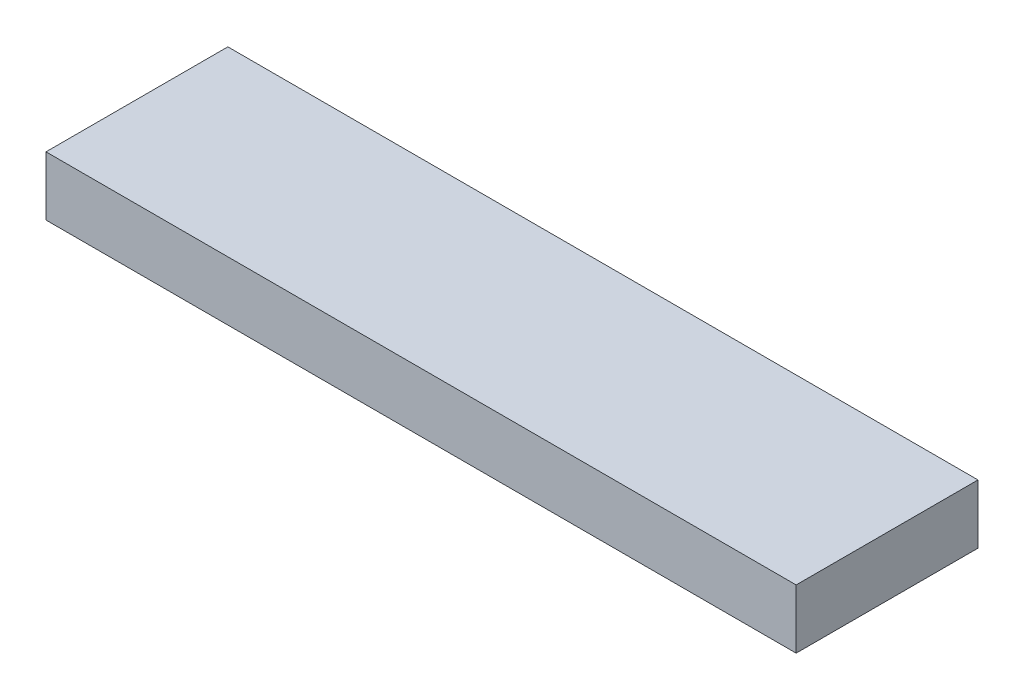
ISO-10303-21;
HEADER;
FILE_DESCRIPTION(('STEP AP214'),'2;1');
FILE_NAME('part.step','',(''),(''),'','','');
FILE_SCHEMA(('AUTOMOTIVE_DESIGN { 1 0 10303 214 1 1 1 1 }'));
ENDSEC;
DATA;
#1=APPLICATION_CONTEXT('core data for automotive mechanical design processes');
#2=APPLICATION_PROTOCOL_DEFINITION('international standard','automotive_design',2000,#1);
#3=PRODUCT_CONTEXT('',#1,'mechanical');
#4=PRODUCT('Part','Part','',(#3));
#5=PRODUCT_RELATED_PRODUCT_CATEGORY('part','',(#4));
#6=PRODUCT_DEFINITION_FORMATION('','',#4);
#7=PRODUCT_DEFINITION_CONTEXT('part definition',#1,'design');
#8=PRODUCT_DEFINITION('design','',#6,#7);
#9=PRODUCT_DEFINITION_SHAPE('','',#8);
#10=(LENGTH_UNIT() NAMED_UNIT(*) SI_UNIT(.MILLI.,.METRE.));
#11=(NAMED_UNIT(*) PLANE_ANGLE_UNIT() SI_UNIT($,.RADIAN.));
#12=(NAMED_UNIT(*) SI_UNIT($,.STERADIAN.) SOLID_ANGLE_UNIT());
#13=UNCERTAINTY_MEASURE_WITH_UNIT(LENGTH_MEASURE(1.E-05),#10,'distance_accuracy_value','');
#14=(GEOMETRIC_REPRESENTATION_CONTEXT(3) GLOBAL_UNCERTAINTY_ASSIGNED_CONTEXT((#13)) GLOBAL_UNIT_ASSIGNED_CONTEXT((#10,
#11,#12)) REPRESENTATION_CONTEXT('',''));
#15=CARTESIAN_POINT('',(0.,0.,0.));
#16=DIRECTION('',(0.,0.,1.));
#17=DIRECTION('',(1.,0.,0.));
#18=AXIS2_PLACEMENT_3D('',#15,#16,#17);
#19=CARTESIAN_POINT('',(20.955,3.302,-5.08));
#20=DIRECTION('',(-1.,0.,0.));
#21=DIRECTION('',(0.,0.,1.));
#22=AXIS2_PLACEMENT_3D('',#19,#20,#21);
#23=PLANE('',#22);
#24=DIRECTION('',(0.,0.,-1.));
#25=VECTOR('',#24,1.);
#26=CARTESIAN_POINT('',(20.955,0.,-5.08));
#27=LINE('',#26,#25);
#28=CARTESIAN_POINT('',(20.955,0.,5.08));
#29=VERTEX_POINT('',#28);
#30=CARTESIAN_POINT('',(20.955,0.,-5.08));
#31=VERTEX_POINT('',#30);
#32=EDGE_CURVE('E106',#29,#31,#27,.T.);
#33=ORIENTED_EDGE('',*,*,#32,.T.);
#34=DIRECTION('',(0.,-1.,0.));
#35=VECTOR('',#34,1.);
#36=CARTESIAN_POINT('',(20.955,3.302,-5.08));
#37=LINE('',#36,#35);
#38=CARTESIAN_POINT('',(20.955,3.302,-5.08));
#39=VERTEX_POINT('',#38);
#40=EDGE_CURVE('E97',#39,#31,#37,.T.);
#41=ORIENTED_EDGE('',*,*,#40,.F.);
#42=DIRECTION('',(0.,0.,-1.));
#43=VECTOR('',#42,1.);
#44=CARTESIAN_POINT('',(20.955,3.302,-5.08));
#45=LINE('',#44,#43);
#46=CARTESIAN_POINT('',(20.955,3.302,5.08));
#47=VERTEX_POINT('',#46);
#48=EDGE_CURVE('E91',#47,#39,#45,.T.);
#49=ORIENTED_EDGE('',*,*,#48,.F.);
#50=DIRECTION('',(0.,-1.,0.));
#51=VECTOR('',#50,1.);
#52=CARTESIAN_POINT('',(20.955,3.302,5.08));
#53=LINE('',#52,#51);
#54=EDGE_CURVE('E102',#47,#29,#53,.T.);
#55=ORIENTED_EDGE('',*,*,#54,.T.);
#56=EDGE_LOOP('',(#33,#41,#49,#55));
#57=FACE_BOUND('',#56,.T.);
#58=ADVANCED_FACE('F39',(#57),#23,.F.);
#59=CARTESIAN_POINT('',(-20.955,3.302,-5.08));
#60=DIRECTION('',(0.,0.,1.));
#61=DIRECTION('',(1.,0.,0.));
#62=AXIS2_PLACEMENT_3D('',#59,#60,#61);
#63=PLANE('',#62);
#64=DIRECTION('',(-1.,0.,0.));
#65=VECTOR('',#64,1.);
#66=CARTESIAN_POINT('',(-20.955,0.,-5.08));
#67=LINE('',#66,#65);
#68=CARTESIAN_POINT('',(-20.955,0.,-5.08));
#69=VERTEX_POINT('',#68);
#70=EDGE_CURVE('E96',#31,#69,#67,.T.);
#71=ORIENTED_EDGE('',*,*,#70,.T.);
#72=DIRECTION('',(0.,-1.,0.));
#73=VECTOR('',#72,1.);
#74=CARTESIAN_POINT('',(-20.955,3.302,-5.08));
#75=LINE('',#74,#73);
#76=CARTESIAN_POINT('',(-20.955,3.302,-5.08));
#77=VERTEX_POINT('',#76);
#78=EDGE_CURVE('E94',#77,#69,#75,.T.);
#79=ORIENTED_EDGE('',*,*,#78,.F.);
#80=DIRECTION('',(-1.,0.,0.));
#81=VECTOR('',#80,1.);
#82=CARTESIAN_POINT('',(-20.955,3.302,-5.08));
#83=LINE('',#82,#81);
#84=EDGE_CURVE('E86',#39,#77,#83,.T.);
#85=ORIENTED_EDGE('',*,*,#84,.F.);
#86=ORIENTED_EDGE('',*,*,#40,.T.);
#87=EDGE_LOOP('',(#71,#79,#85,#86));
#88=FACE_BOUND('',#87,.T.);
#89=ADVANCED_FACE('F95',(#88),#63,.F.);
#90=CARTESIAN_POINT('',(-20.955,3.302,-5.08));
#91=DIRECTION('',(1.,0.,0.));
#92=DIRECTION('',(0.,0.,-1.));
#93=AXIS2_PLACEMENT_3D('',#90,#91,#92);
#94=PLANE('',#93);
#95=DIRECTION('',(0.,0.,1.));
#96=VECTOR('',#95,1.);
#97=CARTESIAN_POINT('',(-20.955,0.,-5.08));
#98=LINE('',#97,#96);
#99=CARTESIAN_POINT('',(-20.955,0.,5.08));
#100=VERTEX_POINT('',#99);
#101=EDGE_CURVE('E72',#69,#100,#98,.T.);
#102=ORIENTED_EDGE('',*,*,#101,.T.);
#103=DIRECTION('',(0.,-1.,0.));
#104=VECTOR('',#103,1.);
#105=CARTESIAN_POINT('',(-20.955,3.302,5.08));
#106=LINE('',#105,#104);
#107=CARTESIAN_POINT('',(-20.955,3.302,5.08));
#108=VERTEX_POINT('',#107);
#109=EDGE_CURVE('E98',#108,#100,#106,.T.);
#110=ORIENTED_EDGE('',*,*,#109,.F.);
#111=DIRECTION('',(0.,0.,1.));
#112=VECTOR('',#111,1.);
#113=CARTESIAN_POINT('',(-20.955,3.302,-5.08));
#114=LINE('',#113,#112);
#115=EDGE_CURVE('E89',#77,#108,#114,.T.);
#116=ORIENTED_EDGE('',*,*,#115,.F.);
#117=ORIENTED_EDGE('',*,*,#78,.T.);
#118=EDGE_LOOP('',(#102,#110,#116,#117));
#119=FACE_BOUND('',#118,.T.);
#120=ADVANCED_FACE('F100',(#119),#94,.F.);
#121=CARTESIAN_POINT('',(-20.955,3.302,5.08));
#122=DIRECTION('',(0.,0.,-1.));
#123=DIRECTION('',(-1.,0.,0.));
#124=AXIS2_PLACEMENT_3D('',#121,#122,#123);
#125=PLANE('',#124);
#126=DIRECTION('',(1.,0.,0.));
#127=VECTOR('',#126,1.);
#128=CARTESIAN_POINT('',(-20.955,0.,5.08));
#129=LINE('',#128,#127);
#130=EDGE_CURVE('E78',#100,#29,#129,.T.);
#131=ORIENTED_EDGE('',*,*,#130,.T.);
#132=ORIENTED_EDGE('',*,*,#54,.F.);
#133=DIRECTION('',(1.,0.,0.));
#134=VECTOR('',#133,1.);
#135=CARTESIAN_POINT('',(-20.955,3.302,5.08));
#136=LINE('',#135,#134);
#137=EDGE_CURVE('E55',#108,#47,#136,.T.);
#138=ORIENTED_EDGE('',*,*,#137,.F.);
#139=ORIENTED_EDGE('',*,*,#109,.T.);
#140=EDGE_LOOP('',(#131,#132,#138,#139));
#141=FACE_BOUND('',#140,.T.);
#142=ADVANCED_FACE('F138',(#141),#125,.F.);
#143=CARTESIAN_POINT('',(0.,3.302,0.));
#144=DIRECTION('',(0.,1.,0.));
#145=DIRECTION('',(0.,0.,1.));
#146=AXIS2_PLACEMENT_3D('',#143,#144,#145);
#147=PLANE('',#146);
#148=ORIENTED_EDGE('',*,*,#48,.T.);
#149=ORIENTED_EDGE('',*,*,#84,.T.);
#150=ORIENTED_EDGE('',*,*,#115,.T.);
#151=ORIENTED_EDGE('',*,*,#137,.T.);
#152=EDGE_LOOP('',(#148,#149,#150,#151));
#153=FACE_BOUND('',#152,.T.);
#154=ADVANCED_FACE('F87',(#153),#147,.T.);
#155=CARTESIAN_POINT('',(0.,0.,0.));
#156=DIRECTION('',(0.,1.,0.));
#157=DIRECTION('',(0.,0.,1.));
#158=AXIS2_PLACEMENT_3D('',#155,#156,#157);
#159=PLANE('',#158);
#160=CARTESIAN_POINT('',(13.462,0.,0.));
#161=DIRECTION('',(0.,1.,0.));
#162=DIRECTION('',(0.,0.,1.));
#163=AXIS2_PLACEMENT_3D('',#160,#161,#162);
#164=CIRCLE('',#163,1.17403767481021);
#165=CARTESIAN_POINT('',(13.462,0.,1.17403767481022));
#166=VERTEX_POINT('',#165);
#167=EDGE_CURVE('E11',#166,#166,#164,.F.);
#168=ORIENTED_EDGE('',*,*,#167,.F.);
#169=EDGE_LOOP('',(#168));
#170=FACE_BOUND('',#169,.T.);
#171=CARTESIAN_POINT('',(8.128,0.,0.));
#172=DIRECTION('',(0.,1.,0.));
#173=DIRECTION('',(0.,0.,1.));
#174=AXIS2_PLACEMENT_3D('',#171,#172,#173);
#175=CIRCLE('',#174,1.17403767481021);
#176=CARTESIAN_POINT('',(8.128,0.,1.17403767481022));
#177=VERTEX_POINT('',#176);
#178=EDGE_CURVE('E47',#177,#177,#175,.F.);
#179=ORIENTED_EDGE('',*,*,#178,.F.);
#180=EDGE_LOOP('',(#179));
#181=FACE_BOUND('',#180,.T.);
#182=CARTESIAN_POINT('',(-8.128,0.,0.));
#183=DIRECTION('',(0.,1.,0.));
#184=DIRECTION('',(0.,0.,1.));
#185=AXIS2_PLACEMENT_3D('',#182,#183,#184);
#186=CIRCLE('',#185,1.17403767481021);
#187=CARTESIAN_POINT('',(-8.128,0.,1.17403767481022));
#188=VERTEX_POINT('',#187);
#189=EDGE_CURVE('E119',#188,#188,#186,.F.);
#190=ORIENTED_EDGE('',*,*,#189,.F.);
#191=EDGE_LOOP('',(#190));
#192=FACE_BOUND('',#191,.T.);
#193=CARTESIAN_POINT('',(-13.462,0.,0.));
#194=DIRECTION('',(0.,1.,0.));
#195=DIRECTION('',(0.,0.,1.));
#196=AXIS2_PLACEMENT_3D('',#193,#194,#195);
#197=CIRCLE('',#196,1.17403767481021);
#198=CARTESIAN_POINT('',(-13.462,0.,1.17403767481022));
#199=VERTEX_POINT('',#198);
#200=EDGE_CURVE('E116',#199,#199,#197,.F.);
#201=ORIENTED_EDGE('',*,*,#200,.F.);
#202=EDGE_LOOP('',(#201));
#203=FACE_BOUND('',#202,.T.);
#204=ORIENTED_EDGE('',*,*,#32,.F.);
#205=ORIENTED_EDGE('',*,*,#130,.F.);
#206=ORIENTED_EDGE('',*,*,#101,.F.);
#207=ORIENTED_EDGE('',*,*,#70,.F.);
#208=EDGE_LOOP('',(#204,#205,#206,#207));
#209=FACE_BOUND('',#208,.T.);
#210=ADVANCED_FACE('F126',(#170,#181,#192,#203,#209),#159,.F.);
#211=CARTESIAN_POINT('',(-13.462,-0.635,0.));
#212=DIRECTION('',(0.,1.,0.));
#213=DIRECTION('',(0.,0.,1.));
#214=AXIS2_PLACEMENT_3D('',#211,#212,#213);
#215=CYLINDRICAL_SURFACE('',#214,1.17403767481021);
#216=CARTESIAN_POINT('',(-13.462,-0.635,0.));
#217=DIRECTION('',(0.,-1.,0.));
#218=DIRECTION('',(0.,0.,-1.));
#219=AXIS2_PLACEMENT_3D('',#216,#217,#218);
#220=CIRCLE('',#219,1.17403767481021);
#221=CARTESIAN_POINT('',(-13.462,-0.635,-1.17403767481021));
#222=VERTEX_POINT('',#221);
#223=EDGE_CURVE('E109',#222,#222,#220,.T.);
#224=ORIENTED_EDGE('',*,*,#223,.F.);
#225=EDGE_LOOP('',(#224));
#226=FACE_BOUND('',#225,.T.);
#227=ORIENTED_EDGE('',*,*,#200,.T.);
#228=EDGE_LOOP('',(#227));
#229=FACE_BOUND('',#228,.T.);
#230=ADVANCED_FACE('F129',(#226,#229),#215,.T.);
#231=CARTESIAN_POINT('',(-13.462,-0.635,0.));
#232=DIRECTION('',(0.,-1.,0.));
#233=DIRECTION('',(0.,0.,-1.));
#234=AXIS2_PLACEMENT_3D('',#231,#232,#233);
#235=PLANE('',#234);
#236=ORIENTED_EDGE('',*,*,#223,.T.);
#237=EDGE_LOOP('',(#236));
#238=FACE_BOUND('',#237,.T.);
#239=ADVANCED_FACE('F184',(#238),#235,.T.);
#240=CARTESIAN_POINT('',(-8.128,-0.635,0.));
#241=DIRECTION('',(0.,1.,0.));
#242=DIRECTION('',(0.,0.,1.));
#243=AXIS2_PLACEMENT_3D('',#240,#241,#242);
#244=CYLINDRICAL_SURFACE('',#243,1.17403767481021);
#245=CARTESIAN_POINT('',(-8.128,-0.635,0.));
#246=DIRECTION('',(0.,-1.,0.));
#247=DIRECTION('',(0.,0.,1.));
#248=AXIS2_PLACEMENT_3D('',#245,#246,#247);
#249=CIRCLE('',#248,1.17403767481021);
#250=CARTESIAN_POINT('',(-8.128,-0.635,1.17403767481022));
#251=VERTEX_POINT('',#250);
#252=EDGE_CURVE('E262',#251,#251,#249,.T.);
#253=ORIENTED_EDGE('',*,*,#252,.F.);
#254=EDGE_LOOP('',(#253));
#255=FACE_BOUND('',#254,.T.);
#256=ORIENTED_EDGE('',*,*,#189,.T.);
#257=EDGE_LOOP('',(#256));
#258=FACE_BOUND('',#257,.T.);
#259=ADVANCED_FACE('F194',(#255,#258),#244,.T.);
#260=CARTESIAN_POINT('',(-8.128,-0.635,0.));
#261=DIRECTION('',(0.,1.,0.));
#262=DIRECTION('',(0.,0.,1.));
#263=AXIS2_PLACEMENT_3D('',#260,#261,#262);
#264=PLANE('',#263);
#265=ORIENTED_EDGE('',*,*,#252,.T.);
#266=EDGE_LOOP('',(#265));
#267=FACE_BOUND('',#266,.T.);
#268=ADVANCED_FACE('F204',(#267),#264,.F.);
#269=CARTESIAN_POINT('',(8.128,-0.635,0.));
#270=DIRECTION('',(0.,1.,0.));
#271=DIRECTION('',(0.,0.,1.));
#272=AXIS2_PLACEMENT_3D('',#269,#270,#271);
#273=CYLINDRICAL_SURFACE('',#272,1.17403767481021);
#274=CARTESIAN_POINT('',(8.128,-0.635,0.));
#275=DIRECTION('',(0.,-1.,0.));
#276=DIRECTION('',(0.,0.,-1.));
#277=AXIS2_PLACEMENT_3D('',#274,#275,#276);
#278=CIRCLE('',#277,1.17403767481021);
#279=CARTESIAN_POINT('',(8.128,-0.635,-1.17403767481021));
#280=VERTEX_POINT('',#279);
#281=EDGE_CURVE('E259',#280,#280,#278,.T.);
#282=ORIENTED_EDGE('',*,*,#281,.F.);
#283=EDGE_LOOP('',(#282));
#284=FACE_BOUND('',#283,.T.);
#285=ORIENTED_EDGE('',*,*,#178,.T.);
#286=EDGE_LOOP('',(#285));
#287=FACE_BOUND('',#286,.T.);
#288=ADVANCED_FACE('F124',(#284,#287),#273,.T.);
#289=CARTESIAN_POINT('',(8.128,-0.635,0.));
#290=DIRECTION('',(0.,-1.,0.));
#291=DIRECTION('',(0.,0.,-1.));
#292=AXIS2_PLACEMENT_3D('',#289,#290,#291);
#293=PLANE('',#292);
#294=ORIENTED_EDGE('',*,*,#281,.T.);
#295=EDGE_LOOP('',(#294));
#296=FACE_BOUND('',#295,.T.);
#297=ADVANCED_FACE('F223',(#296),#293,.T.);
#298=CARTESIAN_POINT('',(13.462,-0.635,0.));
#299=DIRECTION('',(0.,1.,0.));
#300=DIRECTION('',(0.,0.,1.));
#301=AXIS2_PLACEMENT_3D('',#298,#299,#300);
#302=CYLINDRICAL_SURFACE('',#301,1.17403767481021);
#303=CARTESIAN_POINT('',(13.462,-0.635,0.));
#304=DIRECTION('',(0.,-1.,0.));
#305=DIRECTION('',(0.,0.,1.));
#306=AXIS2_PLACEMENT_3D('',#303,#304,#305);
#307=CIRCLE('',#306,1.17403767481021);
#308=CARTESIAN_POINT('',(13.462,-0.635,1.17403767481022));
#309=VERTEX_POINT('',#308);
#310=EDGE_CURVE('E258',#309,#309,#307,.T.);
#311=ORIENTED_EDGE('',*,*,#310,.F.);
#312=EDGE_LOOP('',(#311));
#313=FACE_BOUND('',#312,.T.);
#314=ORIENTED_EDGE('',*,*,#167,.T.);
#315=EDGE_LOOP('',(#314));
#316=FACE_BOUND('',#315,.T.);
#317=ADVANCED_FACE('F233',(#313,#316),#302,.T.);
#318=CARTESIAN_POINT('',(13.462,-0.635,0.));
#319=DIRECTION('',(0.,1.,0.));
#320=DIRECTION('',(0.,0.,1.));
#321=AXIS2_PLACEMENT_3D('',#318,#319,#320);
#322=PLANE('',#321);
#323=ORIENTED_EDGE('',*,*,#310,.T.);
#324=EDGE_LOOP('',(#323));
#325=FACE_BOUND('',#324,.T.);
#326=ADVANCED_FACE('F243',(#325),#322,.F.);
#327=CLOSED_SHELL('',(#58,#89,#120,#142,#154,#210,#230,#239,#259,#268,#288,#297,#317,#326));
#328=MANIFOLD_SOLID_BREP('B2',#327);
#329=ADVANCED_BREP_SHAPE_REPRESENTATION('',(#18,#328),#14);
#330=SHAPE_DEFINITION_REPRESENTATION(#9,#329);
ENDSEC;
END-ISO-10303-21;
